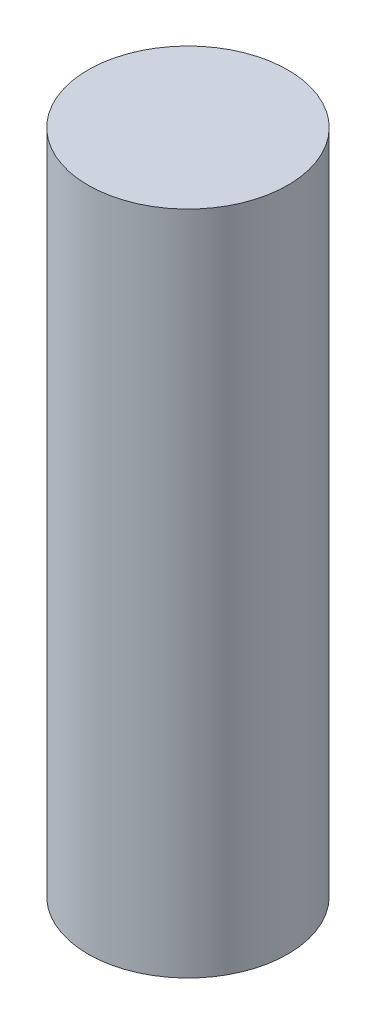
ISO-10303-21;
HEADER;
FILE_DESCRIPTION(('STEP AP214'),'2;1');
FILE_NAME('part.step','',(''),(''),'','','');
FILE_SCHEMA(('AUTOMOTIVE_DESIGN { 1 0 10303 214 1 1 1 1 }'));
ENDSEC;
DATA;
#1=APPLICATION_CONTEXT('core data for automotive mechanical design processes');
#2=APPLICATION_PROTOCOL_DEFINITION('international standard','automotive_design',2000,#1);
#3=PRODUCT_CONTEXT('',#1,'mechanical');
#4=PRODUCT('Part','Part','',(#3));
#5=PRODUCT_RELATED_PRODUCT_CATEGORY('part','',(#4));
#6=PRODUCT_DEFINITION_FORMATION('','',#4);
#7=PRODUCT_DEFINITION_CONTEXT('part definition',#1,'design');
#8=PRODUCT_DEFINITION('design','',#6,#7);
#9=PRODUCT_DEFINITION_SHAPE('','',#8);
#10=(LENGTH_UNIT() NAMED_UNIT(*) SI_UNIT(.MILLI.,.METRE.));
#11=(NAMED_UNIT(*) PLANE_ANGLE_UNIT() SI_UNIT($,.RADIAN.));
#12=(NAMED_UNIT(*) SI_UNIT($,.STERADIAN.) SOLID_ANGLE_UNIT());
#13=UNCERTAINTY_MEASURE_WITH_UNIT(LENGTH_MEASURE(1.E-05),#10,'distance_accuracy_value','');
#14=(GEOMETRIC_REPRESENTATION_CONTEXT(3) GLOBAL_UNCERTAINTY_ASSIGNED_CONTEXT((#13)) GLOBAL_UNIT_ASSIGNED_CONTEXT((#10,
#11,#12)) REPRESENTATION_CONTEXT('',''));
#15=CARTESIAN_POINT('',(0.,0.,0.));
#16=DIRECTION('',(0.,0.,1.));
#17=DIRECTION('',(1.,0.,0.));
#18=AXIS2_PLACEMENT_3D('',#15,#16,#17);
#19=CARTESIAN_POINT('',(0.,40.,0.));
#20=DIRECTION('',(0.,-1.,0.));
#21=DIRECTION('',(0.,0.,-1.));
#22=AXIS2_PLACEMENT_3D('',#19,#20,#21);
#23=CYLINDRICAL_SURFACE('',#22,6.);
#24=CARTESIAN_POINT('',(0.,40.,0.));
#25=DIRECTION('',(0.,1.,0.));
#26=DIRECTION('',(0.,0.,1.));
#27=AXIS2_PLACEMENT_3D('',#24,#25,#26);
#28=CIRCLE('',#27,6.);
#29=CARTESIAN_POINT('',(0.,40.,6.));
#30=VERTEX_POINT('',#29);
#31=EDGE_CURVE('E84',#30,#30,#28,.T.);
#32=ORIENTED_EDGE('',*,*,#31,.F.);
#33=EDGE_LOOP('',(#32));
#34=FACE_BOUND('',#33,.T.);
#35=CARTESIAN_POINT('',(0.,0.,0.));
#36=DIRECTION('',(0.,1.,0.));
#37=DIRECTION('',(0.,0.,1.));
#38=AXIS2_PLACEMENT_3D('',#35,#36,#37);
#39=CIRCLE('',#38,6.);
#40=CARTESIAN_POINT('',(0.,0.,6.));
#41=VERTEX_POINT('',#40);
#42=EDGE_CURVE('E82',#41,#41,#39,.T.);
#43=ORIENTED_EDGE('',*,*,#42,.T.);
#44=EDGE_LOOP('',(#43));
#45=FACE_BOUND('',#44,.T.);
#46=ADVANCED_FACE('F39',(#34,#45),#23,.T.);
#47=CARTESIAN_POINT('',(0.,40.,0.));
#48=DIRECTION('',(0.,1.,0.));
#49=DIRECTION('',(0.,0.,1.));
#50=AXIS2_PLACEMENT_3D('',#47,#48,#49);
#51=PLANE('',#50);
#52=ORIENTED_EDGE('',*,*,#31,.T.);
#53=EDGE_LOOP('',(#52));
#54=FACE_BOUND('',#53,.T.);
#55=ADVANCED_FACE('F95',(#54),#51,.T.);
#56=CARTESIAN_POINT('',(0.,0.,0.));
#57=DIRECTION('',(0.,1.,0.));
#58=DIRECTION('',(0.,0.,1.));
#59=AXIS2_PLACEMENT_3D('',#56,#57,#58);
#60=PLANE('',#59);
#61=DIRECTION('',(-1.,0.,0.));
#62=VECTOR('',#61,1.);
#63=CARTESIAN_POINT('',(0.,0.,2.09));
#64=LINE('',#63,#62);
#65=CARTESIAN_POINT('',(1.64544826719043,0.,2.09));
#66=VERTEX_POINT('',#65);
#67=CARTESIAN_POINT('',(-1.64544826719043,0.,2.09));
#68=VERTEX_POINT('',#67);
#69=EDGE_CURVE('E48',#66,#68,#64,.T.);
#70=ORIENTED_EDGE('',*,*,#69,.F.);
#71=CARTESIAN_POINT('',(0.,0.,0.));
#72=DIRECTION('',(0.,-1.,0.));
#73=DIRECTION('',(0.,0.,-1.));
#74=AXIS2_PLACEMENT_3D('',#71,#72,#73);
#75=CIRCLE('',#74,2.66);
#76=EDGE_CURVE('E11',#66,#68,#75,.F.);
#77=ORIENTED_EDGE('',*,*,#76,.T.);
#78=EDGE_LOOP('',(#70,#77));
#79=FACE_BOUND('',#78,.T.);
#80=ORIENTED_EDGE('',*,*,#42,.F.);
#81=EDGE_LOOP('',(#80));
#82=FACE_BOUND('',#81,.T.);
#83=ADVANCED_FACE('F92',(#79,#82),#60,.F.);
#84=CARTESIAN_POINT('',(0.,30.,0.));
#85=DIRECTION('',(0.,-1.,0.));
#86=DIRECTION('',(0.,0.,-1.));
#87=AXIS2_PLACEMENT_3D('',#84,#85,#86);
#88=CYLINDRICAL_SURFACE('',#87,2.66);
#89=DIRECTION('',(0.,-1.,0.));
#90=VECTOR('',#89,1.);
#91=CARTESIAN_POINT('',(1.64544826719043,30.,2.09));
#92=LINE('',#91,#90);
#93=CARTESIAN_POINT('',(1.64544826719043,30.,2.09));
#94=VERTEX_POINT('',#93);
#95=EDGE_CURVE('E54',#94,#66,#92,.T.);
#96=ORIENTED_EDGE('',*,*,#95,.F.);
#97=CARTESIAN_POINT('',(0.,30.,0.));
#98=DIRECTION('',(0.,-1.,0.));
#99=DIRECTION('',(0.,0.,-1.));
#100=AXIS2_PLACEMENT_3D('',#97,#98,#99);
#101=CIRCLE('',#100,2.66);
#102=CARTESIAN_POINT('',(-1.64544826719043,30.,2.09));
#103=VERTEX_POINT('',#102);
#104=EDGE_CURVE('E70',#103,#94,#101,.T.);
#105=ORIENTED_EDGE('',*,*,#104,.F.);
#106=DIRECTION('',(0.,-1.,0.));
#107=VECTOR('',#106,1.);
#108=CARTESIAN_POINT('',(-1.64544826719043,30.,2.09));
#109=LINE('',#108,#107);
#110=EDGE_CURVE('E65',#103,#68,#109,.T.);
#111=ORIENTED_EDGE('',*,*,#110,.T.);
#112=ORIENTED_EDGE('',*,*,#76,.F.);
#113=EDGE_LOOP('',(#96,#105,#111,#112));
#114=FACE_BOUND('',#113,.T.);
#115=ADVANCED_FACE('F73',(#114),#88,.F.);
#116=CARTESIAN_POINT('',(0.,30.,2.09));
#117=DIRECTION('',(0.,0.,-1.));
#118=DIRECTION('',(-1.,0.,0.));
#119=AXIS2_PLACEMENT_3D('',#116,#117,#118);
#120=PLANE('',#119);
#121=ORIENTED_EDGE('',*,*,#69,.T.);
#122=ORIENTED_EDGE('',*,*,#110,.F.);
#123=DIRECTION('',(1.,0.,0.));
#124=VECTOR('',#123,1.);
#125=CARTESIAN_POINT('',(0.,30.,2.09));
#126=LINE('',#125,#124);
#127=EDGE_CURVE('E62',#103,#94,#126,.T.);
#128=ORIENTED_EDGE('',*,*,#127,.T.);
#129=ORIENTED_EDGE('',*,*,#95,.T.);
#130=EDGE_LOOP('',(#121,#122,#128,#129));
#131=FACE_BOUND('',#130,.T.);
#132=ADVANCED_FACE('F63',(#131),#120,.T.);
#133=CARTESIAN_POINT('',(0.,30.,0.));
#134=DIRECTION('',(0.,-1.,0.));
#135=DIRECTION('',(0.,0.,-1.));
#136=AXIS2_PLACEMENT_3D('',#133,#134,#135);
#137=PLANE('',#136);
#138=ORIENTED_EDGE('',*,*,#104,.T.);
#139=ORIENTED_EDGE('',*,*,#127,.F.);
#140=EDGE_LOOP('',(#138,#139));
#141=FACE_BOUND('',#140,.T.);
#142=ADVANCED_FACE('F77',(#141),#137,.T.);
#143=CLOSED_SHELL('',(#46,#55,#83,#115,#132,#142));
#144=MANIFOLD_SOLID_BREP('B2',#143);
#145=ADVANCED_BREP_SHAPE_REPRESENTATION('',(#18,#144),#14);
#146=SHAPE_DEFINITION_REPRESENTATION(#9,#145);
ENDSEC;
END-ISO-10303-21;
